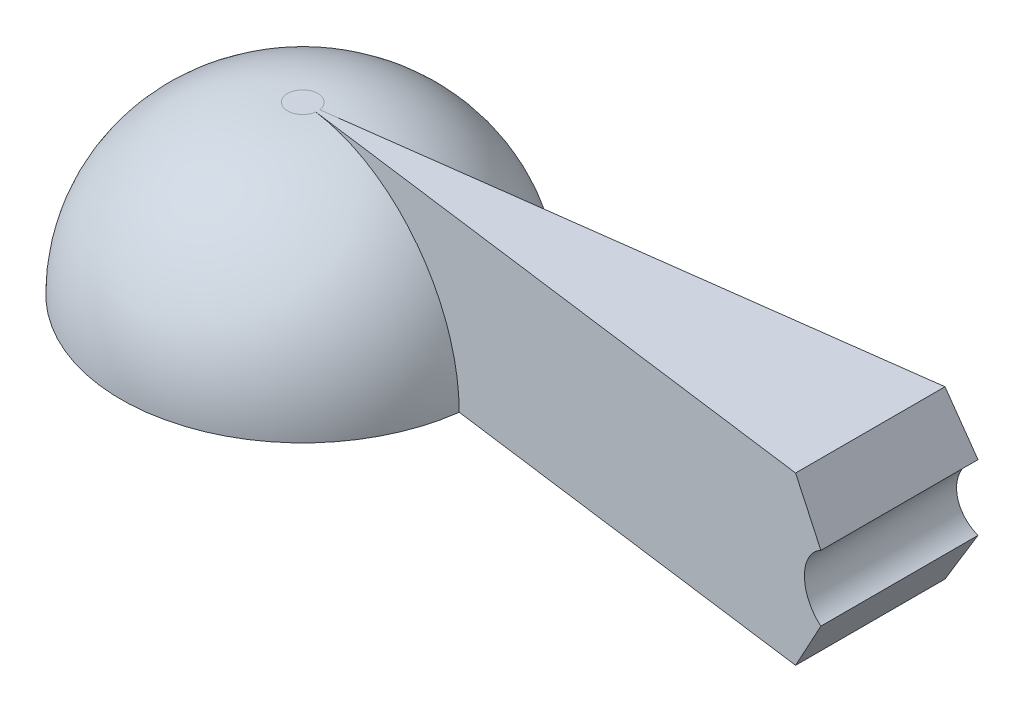
ISO-10303-21;
HEADER;
FILE_DESCRIPTION(('STEP AP214'),'2;1');
FILE_NAME('part.step','',(''),(''),'','','');
FILE_SCHEMA(('AUTOMOTIVE_DESIGN { 1 0 10303 214 1 1 1 1 }'));
ENDSEC;
DATA;
#1=APPLICATION_CONTEXT('core data for automotive mechanical design processes');
#2=APPLICATION_PROTOCOL_DEFINITION('international standard','automotive_design',2000,#1);
#3=PRODUCT_CONTEXT('',#1,'mechanical');
#4=PRODUCT('Part','Part','',(#3));
#5=PRODUCT_RELATED_PRODUCT_CATEGORY('part','',(#4));
#6=PRODUCT_DEFINITION_FORMATION('','',#4);
#7=PRODUCT_DEFINITION_CONTEXT('part definition',#1,'design');
#8=PRODUCT_DEFINITION('design','',#6,#7);
#9=PRODUCT_DEFINITION_SHAPE('','',#8);
#10=(LENGTH_UNIT() NAMED_UNIT(*) SI_UNIT(.MILLI.,.METRE.));
#11=(NAMED_UNIT(*) PLANE_ANGLE_UNIT() SI_UNIT($,.RADIAN.));
#12=(NAMED_UNIT(*) SI_UNIT($,.STERADIAN.) SOLID_ANGLE_UNIT());
#13=UNCERTAINTY_MEASURE_WITH_UNIT(LENGTH_MEASURE(1.E-05),#10,'distance_accuracy_value','');
#14=(GEOMETRIC_REPRESENTATION_CONTEXT(3) GLOBAL_UNCERTAINTY_ASSIGNED_CONTEXT((#13)) GLOBAL_UNIT_ASSIGNED_CONTEXT((#10,
#11,#12)) REPRESENTATION_CONTEXT('',''));
#15=CARTESIAN_POINT('',(0.,0.,0.));
#16=DIRECTION('',(0.,0.,1.));
#17=DIRECTION('',(1.,0.,0.));
#18=AXIS2_PLACEMENT_3D('',#15,#16,#17);
#19=CARTESIAN_POINT('',(-1.27,0.,0.));
#20=DIRECTION('',(0.,1.,0.));
#21=DIRECTION('',(-1.,0.,0.));
#22=AXIS2_PLACEMENT_3D('',#19,#20,#21);
#23=DEGENERATE_TOROIDAL_SURFACE('',#22,1.27,12.7,.T.);
#24=CARTESIAN_POINT('',(-1.27,0.,0.));
#25=DIRECTION('',(0.,1.,0.));
#26=DIRECTION('',(-1.,0.,0.));
#27=AXIS2_PLACEMENT_3D('',#24,#25,#26);
#28=CIRCLE('',#27,13.97);
#29=CARTESIAN_POINT('',(-15.24,0.,0.));
#30=VERTEX_POINT('',#29);
#31=EDGE_CURVE('E110',#30,#30,#28,.T.);
#32=ORIENTED_EDGE('',*,*,#31,.F.);
#33=EDGE_LOOP('',(#32));
#34=FACE_BOUND('',#33,.T.);
#35=CARTESIAN_POINT('',(-1.27,12.7,0.));
#36=DIRECTION('',(0.,1.,0.));
#37=DIRECTION('',(-1.,0.,0.));
#38=AXIS2_PLACEMENT_3D('',#35,#36,#37);
#39=CIRCLE('',#38,1.27);
#40=CARTESIAN_POINT('',(-2.54,12.7,0.));
#41=VERTEX_POINT('',#40);
#42=EDGE_CURVE('E144',#41,#41,#39,.T.);
#43=ORIENTED_EDGE('',*,*,#42,.T.);
#44=EDGE_LOOP('',(#43));
#45=FACE_BOUND('',#44,.T.);
#46=ADVANCED_FACE('F38',(#34,#45),#23,.F.);
#47=CARTESIAN_POINT('',(12.7,0.,0.));
#48=DIRECTION('',(0.,1.,0.));
#49=DIRECTION('',(-1.,0.,0.));
#50=AXIS2_PLACEMENT_3D('',#47,#48,#49);
#51=PLANE('',#50);
#52=DIRECTION('',(0.99144486137381,0.,-0.130526192220052));
#53=VECTOR('',#52,1.);
#54=CARTESIAN_POINT('',(13.8396196873369,0.,-1.98921916943359));
#55=LINE('',#54,#53);
#56=CARTESIAN_POINT('',(13.8396196873369,0.,-1.98921916943359));
#57=VERTEX_POINT('',#56);
#58=CARTESIAN_POINT('',(46.3217423014448,0.,-6.26557173852094));
#59=VERTEX_POINT('',#58);
#60=EDGE_CURVE('E126',#57,#59,#55,.T.);
#61=ORIENTED_EDGE('',*,*,#60,.T.);
#62=DIRECTION('',(0.,0.,1.));
#63=VECTOR('',#62,1.);
#64=CARTESIAN_POINT('',(46.3217423014448,0.,-15.24));
#65=LINE('',#64,#63);
#66=CARTESIAN_POINT('',(46.3217423014448,0.,6.26557173852095));
#67=VERTEX_POINT('',#66);
#68=EDGE_CURVE('E167',#59,#67,#65,.T.);
#69=ORIENTED_EDGE('',*,*,#68,.T.);
#70=DIRECTION('',(0.99144486137381,0.,0.130526192220052));
#71=VECTOR('',#70,1.);
#72=CARTESIAN_POINT('',(13.8396196873369,0.,1.98921916943359));
#73=LINE('',#72,#71);
#74=CARTESIAN_POINT('',(13.8396196873369,0.,1.98921916943359));
#75=VERTEX_POINT('',#74);
#76=EDGE_CURVE('E140',#75,#67,#73,.T.);
#77=ORIENTED_EDGE('',*,*,#76,.F.);
#78=CARTESIAN_POINT('',(-1.27,0.,0.));
#79=DIRECTION('',(0.,1.,0.));
#80=DIRECTION('',(-1.,0.,0.));
#81=AXIS2_PLACEMENT_3D('',#78,#79,#80);
#82=CIRCLE('',#81,15.24);
#83=EDGE_CURVE('E151',#57,#75,#82,.T.);
#84=ORIENTED_EDGE('',*,*,#83,.F.);
#85=EDGE_LOOP('',(#61,#69,#77,#84));
#86=FACE_BOUND('',#85,.T.);
#87=ORIENTED_EDGE('',*,*,#31,.T.);
#88=EDGE_LOOP('',(#87));
#89=FACE_BOUND('',#88,.T.);
#90=ADVANCED_FACE('F184',(#86,#89),#51,.F.);
#91=CARTESIAN_POINT('',(-1.27,0.,0.));
#92=DIRECTION('',(0.,1.,0.));
#93=DIRECTION('',(-1.,0.,0.));
#94=AXIS2_PLACEMENT_3D('',#91,#92,#93);
#95=DEGENERATE_TOROIDAL_SURFACE('',#94,1.27,13.97,.T.);
#96=ORIENTED_EDGE('',*,*,#83,.T.);
#97=CARTESIAN_POINT('',(-0.010865026055261,0.,0.165768264119466));
#98=DIRECTION('',(0.130526192220052,0.,-0.99144486137381));
#99=DIRECTION('',(0.99144486137381,0.,0.130526192220052));
#100=AXIS2_PLACEMENT_3D('',#97,#98,#99);
#101=CIRCLE('',#100,13.97);
#102=CARTESIAN_POINT('',(-0.010865026055261,13.97,0.165768264119466));
#103=VERTEX_POINT('',#102);
#104=EDGE_CURVE('E137',#103,#75,#101,.T.);
#105=ORIENTED_EDGE('',*,*,#104,.F.);
#106=CARTESIAN_POINT('',(-1.27,13.97,0.));
#107=DIRECTION('',(0.,1.,0.));
#108=DIRECTION('',(-1.,0.,0.));
#109=AXIS2_PLACEMENT_3D('',#106,#107,#108);
#110=CIRCLE('',#109,1.27);
#111=CARTESIAN_POINT('',(-0.010865026055257,13.97,-0.165768264119466));
#112=VERTEX_POINT('',#111);
#113=EDGE_CURVE('E148',#112,#103,#110,.T.);
#114=ORIENTED_EDGE('',*,*,#113,.F.);
#115=CARTESIAN_POINT('',(-0.0108650260552609,0.,-0.165768264119466));
#116=DIRECTION('',(-0.130526192220052,0.,-0.99144486137381));
#117=DIRECTION('',(0.99144486137381,0.,-0.130526192220052));
#118=AXIS2_PLACEMENT_3D('',#115,#116,#117);
#119=CIRCLE('',#118,13.97);
#120=EDGE_CURVE('E119',#112,#57,#119,.T.);
#121=ORIENTED_EDGE('',*,*,#120,.T.);
#122=EDGE_LOOP('',(#96,#105,#114,#121));
#123=FACE_BOUND('',#122,.T.);
#124=ADVANCED_FACE('F188',(#123),#95,.T.);
#125=CARTESIAN_POINT('',(0.,13.97,0.));
#126=DIRECTION('',(0.,-1.,0.));
#127=DIRECTION('',(1.,0.,0.));
#128=AXIS2_PLACEMENT_3D('',#125,#126,#127);
#129=PLANE('',#128);
#130=DIRECTION('',(-0.99144486137381,0.,-0.130526192220052));
#131=VECTOR('',#130,1.);
#132=CARTESIAN_POINT('',(-0.010865026055261,13.97,0.165768264119466));
#133=LINE('',#132,#131);
#134=CARTESIAN_POINT('',(46.3217423014448,13.97,6.26557173852094));
#135=VERTEX_POINT('',#134);
#136=EDGE_CURVE('E114',#135,#103,#133,.T.);
#137=ORIENTED_EDGE('',*,*,#136,.F.);
#138=DIRECTION('',(0.,0.,1.));
#139=VECTOR('',#138,1.);
#140=CARTESIAN_POINT('',(46.3217423014448,13.97,-15.24));
#141=LINE('',#140,#139);
#142=CARTESIAN_POINT('',(46.3217423014448,13.97,-6.26557173852094));
#143=VERTEX_POINT('',#142);
#144=EDGE_CURVE('E105',#143,#135,#141,.T.);
#145=ORIENTED_EDGE('',*,*,#144,.F.);
#146=DIRECTION('',(-0.99144486137381,0.,0.130526192220052));
#147=VECTOR('',#146,1.);
#148=CARTESIAN_POINT('',(-0.0108650260552609,13.97,-0.165768264119466));
#149=LINE('',#148,#147);
#150=EDGE_CURVE('E67',#143,#112,#149,.T.);
#151=ORIENTED_EDGE('',*,*,#150,.T.);
#152=ORIENTED_EDGE('',*,*,#113,.T.);
#153=EDGE_LOOP('',(#137,#145,#151,#152));
#154=FACE_BOUND('',#153,.T.);
#155=ADVANCED_FACE('F113',(#154),#129,.F.);
#156=CARTESIAN_POINT('',(0.,12.7,0.));
#157=DIRECTION('',(0.,1.,0.));
#158=DIRECTION('',(-1.,0.,0.));
#159=AXIS2_PLACEMENT_3D('',#156,#157,#158);
#160=PLANE('',#159);
#161=ORIENTED_EDGE('',*,*,#42,.F.);
#162=EDGE_LOOP('',(#161));
#163=FACE_BOUND('',#162,.T.);
#164=ADVANCED_FACE('F195',(#163),#160,.F.);
#165=CARTESIAN_POINT('',(-0.010865026055261,0.,0.165768264119466));
#166=DIRECTION('',(-0.130526192220052,0.,0.99144486137381));
#167=DIRECTION('',(0.99144486137381,0.,0.130526192220052));
#168=AXIS2_PLACEMENT_3D('',#165,#166,#167);
#169=PLANE('',#168);
#170=DIRECTION('',(-0.498920234024523,-0.864155194254635,-0.0656840949062167));
#171=VECTOR('',#170,1.);
#172=CARTESIAN_POINT('',(34.588667407533,-20.3222818452663,4.72088312435748));
#173=LINE('',#172,#171);
#174=CARTESIAN_POINT('',(48.7670339317343,4.2353693429844,6.58750048897811));
#175=VERTEX_POINT('',#174);
#176=EDGE_CURVE('E122',#175,#67,#173,.T.);
#177=ORIENTED_EDGE('',*,*,#176,.F.);
#178=CARTESIAN_POINT('',(50.3545339317343,6.985,6.7964988288981));
#179=DIRECTION('',(-0.130526192220052,0.,0.99144486137381));
#180=DIRECTION('',(0.99144486137381,0.,0.130526192220052));
#181=AXIS2_PLACEMENT_3D('',#178,#179,#180);
#182=ELLIPSE('',#181,3.20239694984199,3.175);
#183=CARTESIAN_POINT('',(48.7670339317343,9.7346306570156,6.58750048897811));
#184=VERTEX_POINT('',#183);
#185=EDGE_CURVE('E129',#184,#175,#182,.T.);
#186=ORIENTED_EDGE('',*,*,#185,.F.);
#187=DIRECTION('',(0.498920234024523,-0.864155194254635,0.0656840949062167));
#188=VECTOR('',#187,1.);
#189=CARTESIAN_POINT('',(40.6117562366949,23.8599859746573,5.51383781190738));
#190=LINE('',#189,#188);
#191=EDGE_CURVE('E172',#135,#184,#190,.T.);
#192=ORIENTED_EDGE('',*,*,#191,.F.);
#193=ORIENTED_EDGE('',*,*,#136,.T.);
#194=ORIENTED_EDGE('',*,*,#104,.T.);
#195=ORIENTED_EDGE('',*,*,#76,.T.);
#196=EDGE_LOOP('',(#177,#186,#192,#193,#194,#195));
#197=FACE_BOUND('',#196,.T.);
#198=ADVANCED_FACE('F179',(#197),#169,.T.);
#199=CARTESIAN_POINT('',(-0.0108650260552609,0.,-0.165768264119466));
#200=DIRECTION('',(0.130526192220052,0.,0.99144486137381));
#201=DIRECTION('',(0.99144486137381,0.,-0.130526192220052));
#202=AXIS2_PLACEMENT_3D('',#199,#200,#201);
#203=PLANE('',#202);
#204=CARTESIAN_POINT('',(50.3545339317343,6.985,-6.7964988288981));
#205=DIRECTION('',(0.130526192220052,0.,0.99144486137381));
#206=DIRECTION('',(-0.99144486137381,0.,0.130526192220052));
#207=AXIS2_PLACEMENT_3D('',#204,#205,#206);
#208=ELLIPSE('',#207,3.20239694984199,3.175);
#209=CARTESIAN_POINT('',(48.7670339317343,9.7346306570156,-6.58750048897811));
#210=VERTEX_POINT('',#209);
#211=CARTESIAN_POINT('',(48.7670339317343,4.2353693429844,-6.58750048897811));
#212=VERTEX_POINT('',#211);
#213=EDGE_CURVE('E46',#210,#212,#208,.T.);
#214=ORIENTED_EDGE('',*,*,#213,.T.);
#215=DIRECTION('',(-0.498920234024523,-0.864155194254635,0.0656840949062167));
#216=VECTOR('',#215,1.);
#217=CARTESIAN_POINT('',(34.588667407533,-20.3222818452663,-4.72088312435747));
#218=LINE('',#217,#216);
#219=EDGE_CURVE('E11',#212,#59,#218,.T.);
#220=ORIENTED_EDGE('',*,*,#219,.T.);
#221=ORIENTED_EDGE('',*,*,#60,.F.);
#222=ORIENTED_EDGE('',*,*,#120,.F.);
#223=ORIENTED_EDGE('',*,*,#150,.F.);
#224=DIRECTION('',(0.498920234024523,-0.864155194254635,-0.0656840949062167));
#225=VECTOR('',#224,1.);
#226=CARTESIAN_POINT('',(40.6117562366949,23.8599859746573,-5.51383781190738));
#227=LINE('',#226,#225);
#228=EDGE_CURVE('E103',#143,#210,#227,.T.);
#229=ORIENTED_EDGE('',*,*,#228,.T.);
#230=EDGE_LOOP('',(#214,#220,#221,#222,#223,#229));
#231=FACE_BOUND('',#230,.T.);
#232=ADVANCED_FACE('F117',(#231),#203,.F.);
#233=CARTESIAN_POINT('',(46.3217423014448,0.,-15.24));
#234=DIRECTION('',(-0.86602540378444,0.499999999999997,0.));
#235=DIRECTION('',(-0.499999999999997,-0.86602540378444,0.));
#236=AXIS2_PLACEMENT_3D('',#233,#234,#235);
#237=PLANE('',#236);
#238=ORIENTED_EDGE('',*,*,#176,.T.);
#239=ORIENTED_EDGE('',*,*,#68,.F.);
#240=ORIENTED_EDGE('',*,*,#219,.F.);
#241=DIRECTION('',(0.,0.,1.));
#242=VECTOR('',#241,1.);
#243=CARTESIAN_POINT('',(48.7670339317343,4.2353693429844,-15.24));
#244=LINE('',#243,#242);
#245=EDGE_CURVE('E163',#212,#175,#244,.T.);
#246=ORIENTED_EDGE('',*,*,#245,.T.);
#247=EDGE_LOOP('',(#238,#239,#240,#246));
#248=FACE_BOUND('',#247,.T.);
#249=ADVANCED_FACE('F182',(#248),#237,.F.);
#250=CARTESIAN_POINT('',(50.3545339317343,6.985,-15.24));
#251=DIRECTION('',(0.,0.,1.));
#252=DIRECTION('',(1.,0.,0.));
#253=AXIS2_PLACEMENT_3D('',#250,#251,#252);
#254=CYLINDRICAL_SURFACE('',#253,3.175);
#255=ORIENTED_EDGE('',*,*,#185,.T.);
#256=ORIENTED_EDGE('',*,*,#245,.F.);
#257=ORIENTED_EDGE('',*,*,#213,.F.);
#258=DIRECTION('',(0.,0.,1.));
#259=VECTOR('',#258,1.);
#260=CARTESIAN_POINT('',(48.7670339317343,9.7346306570156,-15.24));
#261=LINE('',#260,#259);
#262=EDGE_CURVE('E56',#210,#184,#261,.T.);
#263=ORIENTED_EDGE('',*,*,#262,.T.);
#264=EDGE_LOOP('',(#255,#256,#257,#263));
#265=FACE_BOUND('',#264,.T.);
#266=ADVANCED_FACE('F160',(#265),#254,.F.);
#267=CARTESIAN_POINT('',(48.7670339317343,9.7346306570156,-15.24));
#268=DIRECTION('',(-0.86602540378444,-0.499999999999997,0.));
#269=DIRECTION('',(0.499999999999997,-0.86602540378444,0.));
#270=AXIS2_PLACEMENT_3D('',#267,#268,#269);
#271=PLANE('',#270);
#272=ORIENTED_EDGE('',*,*,#191,.T.);
#273=ORIENTED_EDGE('',*,*,#262,.F.);
#274=ORIENTED_EDGE('',*,*,#228,.F.);
#275=ORIENTED_EDGE('',*,*,#144,.T.);
#276=EDGE_LOOP('',(#272,#273,#274,#275));
#277=FACE_BOUND('',#276,.T.);
#278=ADVANCED_FACE('F104',(#277),#271,.F.);
#279=CLOSED_SHELL('',(#46,#90,#124,#155,#164,#198,#232,#249,#266,#278));
#280=MANIFOLD_SOLID_BREP('B2',#279);
#281=ADVANCED_BREP_SHAPE_REPRESENTATION('',(#18,#280),#14);
#282=SHAPE_DEFINITION_REPRESENTATION(#9,#281);
ENDSEC;
END-ISO-10303-21;
